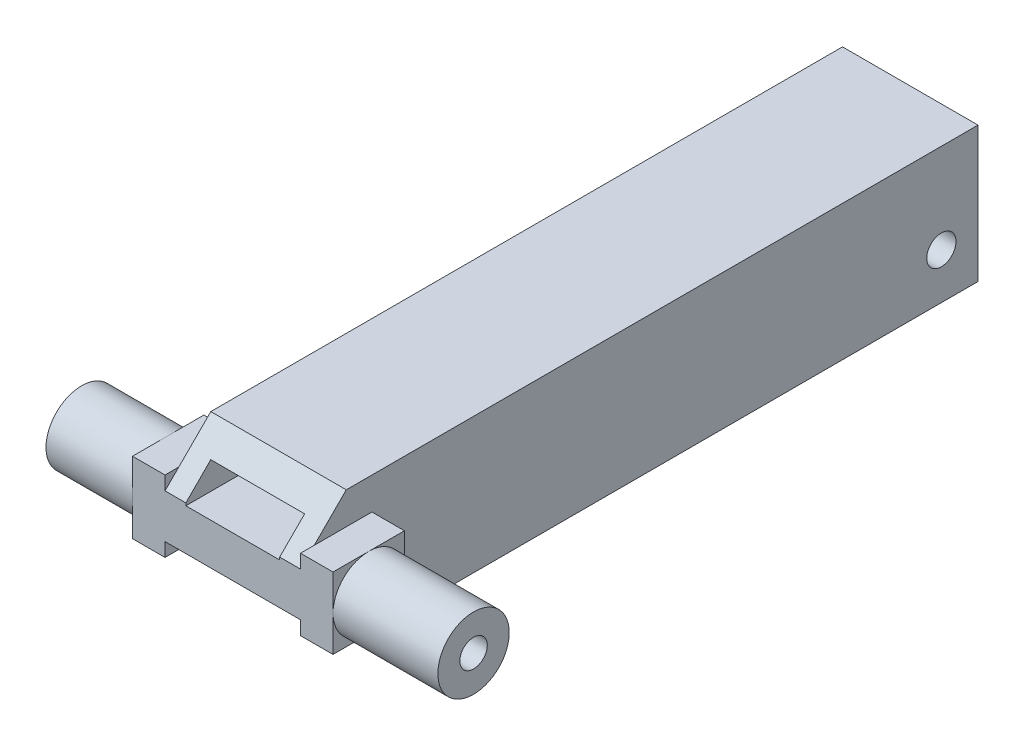
ISO-10303-21;
HEADER;
FILE_DESCRIPTION(('STEP AP214'),'2;1');
FILE_NAME('part.step','',(''),(''),'','','');
FILE_SCHEMA(('AUTOMOTIVE_DESIGN { 1 0 10303 214 1 1 1 1 }'));
ENDSEC;
DATA;
#1=APPLICATION_CONTEXT('core data for automotive mechanical design processes');
#2=APPLICATION_PROTOCOL_DEFINITION('international standard','automotive_design',2000,#1);
#3=PRODUCT_CONTEXT('',#1,'mechanical');
#4=PRODUCT('Part','Part','',(#3));
#5=PRODUCT_RELATED_PRODUCT_CATEGORY('part','',(#4));
#6=PRODUCT_DEFINITION_FORMATION('','',#4);
#7=PRODUCT_DEFINITION_CONTEXT('part definition',#1,'design');
#8=PRODUCT_DEFINITION('design','',#6,#7);
#9=PRODUCT_DEFINITION_SHAPE('','',#8);
#10=(LENGTH_UNIT() NAMED_UNIT(*) SI_UNIT(.MILLI.,.METRE.));
#11=(NAMED_UNIT(*) PLANE_ANGLE_UNIT() SI_UNIT($,.RADIAN.));
#12=(NAMED_UNIT(*) SI_UNIT($,.STERADIAN.) SOLID_ANGLE_UNIT());
#13=UNCERTAINTY_MEASURE_WITH_UNIT(LENGTH_MEASURE(1.E-05),#10,'distance_accuracy_value','');
#14=(GEOMETRIC_REPRESENTATION_CONTEXT(3) GLOBAL_UNCERTAINTY_ASSIGNED_CONTEXT((#13)) GLOBAL_UNIT_ASSIGNED_CONTEXT((#10,
#11,#12)) REPRESENTATION_CONTEXT('',''));
#15=CARTESIAN_POINT('',(0.,0.,0.));
#16=DIRECTION('',(0.,0.,1.));
#17=DIRECTION('',(1.,0.,0.));
#18=AXIS2_PLACEMENT_3D('',#15,#16,#17);
#19=CARTESIAN_POINT('',(14.8,0.,0.));
#20=DIRECTION('',(1.,0.,0.));
#21=DIRECTION('',(0.,0.,-1.));
#22=AXIS2_PLACEMENT_3D('',#19,#20,#21);
#23=PLANE('',#22);
#24=CARTESIAN_POINT('',(14.8,-2.4,-33.));
#25=DIRECTION('',(1.,0.,0.));
#26=DIRECTION('',(0.,0.,-1.));
#27=AXIS2_PLACEMENT_3D('',#24,#25,#26);
#28=CIRCLE('',#27,1.6);
#29=CARTESIAN_POINT('',(14.8,-2.4,-34.6));
#30=VERTEX_POINT('',#29);
#31=EDGE_CURVE('E252',#30,#30,#28,.T.);
#32=ORIENTED_EDGE('',*,*,#31,.F.);
#33=EDGE_LOOP('',(#32));
#34=FACE_BOUND('',#33,.T.);
#35=DIRECTION('',(0.,0.707106781186547,-0.707106781186548));
#36=VECTOR('',#35,1.);
#37=CARTESIAN_POINT('',(14.8,19.7,19.6999999999999));
#38=LINE('',#37,#36);
#39=CARTESIAN_POINT('',(14.8,7.4,32.));
#40=VERTEX_POINT('',#39);
#41=CARTESIAN_POINT('',(14.8,3.9,35.5));
#42=VERTEX_POINT('',#41);
#43=EDGE_CURVE('E412',#40,#42,#38,.F.);
#44=ORIENTED_EDGE('',*,*,#43,.T.);
#45=DIRECTION('',(0.,0.,1.));
#46=VECTOR('',#45,1.);
#47=CARTESIAN_POINT('',(14.8,3.89999999999999,37.));
#48=LINE('',#47,#46);
#49=CARTESIAN_POINT('',(14.8,3.89999999999999,29.2));
#50=VERTEX_POINT('',#49);
#51=EDGE_CURVE('E277',#50,#42,#48,.T.);
#52=ORIENTED_EDGE('',*,*,#51,.F.);
#53=DIRECTION('',(0.,1.,0.));
#54=VECTOR('',#53,1.);
#55=CARTESIAN_POINT('',(14.8,-3.89999999999999,29.2));
#56=LINE('',#55,#54);
#57=CARTESIAN_POINT('',(14.8,-3.89999999999999,29.2));
#58=VERTEX_POINT('',#57);
#59=EDGE_CURVE('E255',#58,#50,#56,.T.);
#60=ORIENTED_EDGE('',*,*,#59,.F.);
#61=DIRECTION('',(0.,0.,-1.));
#62=VECTOR('',#61,1.);
#63=CARTESIAN_POINT('',(14.8,-3.9,37.));
#64=LINE('',#63,#62);
#65=CARTESIAN_POINT('',(14.8,-3.89999999999999,35.5));
#66=VERTEX_POINT('',#65);
#67=EDGE_CURVE('E280',#66,#58,#64,.T.);
#68=ORIENTED_EDGE('',*,*,#67,.F.);
#69=DIRECTION('',(0.,0.707106781186549,0.707106781186546));
#70=VECTOR('',#69,1.);
#71=CARTESIAN_POINT('',(14.8,-19.7,19.7000000000001));
#72=LINE('',#71,#70);
#73=CARTESIAN_POINT('',(14.8,-7.4,32.));
#74=VERTEX_POINT('',#73);
#75=EDGE_CURVE('E415',#66,#74,#72,.F.);
#76=ORIENTED_EDGE('',*,*,#75,.T.);
#77=DIRECTION('',(0.,0.,-1.));
#78=VECTOR('',#77,1.);
#79=CARTESIAN_POINT('',(14.8,-7.4,-37.));
#80=LINE('',#79,#78);
#81=CARTESIAN_POINT('',(14.8,-7.4,-37.));
#82=VERTEX_POINT('',#81);
#83=EDGE_CURVE('E379',#74,#82,#80,.T.);
#84=ORIENTED_EDGE('',*,*,#83,.T.);
#85=DIRECTION('',(0.,1.,0.));
#86=VECTOR('',#85,1.);
#87=CARTESIAN_POINT('',(14.8,-7.4,-37.));
#88=LINE('',#87,#86);
#89=CARTESIAN_POINT('',(14.8,7.40000000000001,-37.));
#90=VERTEX_POINT('',#89);
#91=EDGE_CURVE('E381',#82,#90,#88,.T.);
#92=ORIENTED_EDGE('',*,*,#91,.T.);
#93=DIRECTION('',(0.,0.,1.));
#94=VECTOR('',#93,1.);
#95=CARTESIAN_POINT('',(14.8,7.40000000000001,-37.));
#96=LINE('',#95,#94);
#97=EDGE_CURVE('E384',#90,#40,#96,.T.);
#98=ORIENTED_EDGE('',*,*,#97,.T.);
#99=EDGE_LOOP('',(#44,#52,#60,#68,#76,#84,#92,#98));
#100=FACE_BOUND('',#99,.T.);
#101=ADVANCED_FACE('F34',(#34,#100),#23,.T.);
#102=CARTESIAN_POINT('',(0.,0.,0.));
#103=DIRECTION('',(1.,0.,0.));
#104=DIRECTION('',(0.,0.,-1.));
#105=AXIS2_PLACEMENT_3D('',#102,#103,#104);
#106=PLANE('',#105);
#107=CARTESIAN_POINT('',(0.,-2.4,-33.));
#108=DIRECTION('',(-1.,0.,0.));
#109=DIRECTION('',(0.,0.,1.));
#110=AXIS2_PLACEMENT_3D('',#107,#108,#109);
#111=CIRCLE('',#110,1.6);
#112=CARTESIAN_POINT('',(0.,-2.4,-31.4));
#113=VERTEX_POINT('',#112);
#114=EDGE_CURVE('E243',#113,#113,#111,.T.);
#115=ORIENTED_EDGE('',*,*,#114,.F.);
#116=EDGE_LOOP('',(#115));
#117=FACE_BOUND('',#116,.T.);
#118=DIRECTION('',(0.,0.,1.));
#119=VECTOR('',#118,1.);
#120=CARTESIAN_POINT('',(0.,-3.89999999999999,37.));
#121=LINE('',#120,#119);
#122=CARTESIAN_POINT('',(0.,-3.89999999999999,29.2));
#123=VERTEX_POINT('',#122);
#124=CARTESIAN_POINT('',(0.,-3.89999999999999,35.5));
#125=VERTEX_POINT('',#124);
#126=EDGE_CURVE('E325',#123,#125,#121,.T.);
#127=ORIENTED_EDGE('',*,*,#126,.F.);
#128=DIRECTION('',(0.,-1.,0.));
#129=VECTOR('',#128,1.);
#130=CARTESIAN_POINT('',(0.,-3.89999999999999,29.2));
#131=LINE('',#130,#129);
#132=CARTESIAN_POINT('',(0.,3.89999999999999,29.2));
#133=VERTEX_POINT('',#132);
#134=EDGE_CURVE('E320',#133,#123,#131,.T.);
#135=ORIENTED_EDGE('',*,*,#134,.F.);
#136=DIRECTION('',(0.,0.,-1.));
#137=VECTOR('',#136,1.);
#138=CARTESIAN_POINT('',(0.,3.89999999999999,37.));
#139=LINE('',#138,#137);
#140=CARTESIAN_POINT('',(0.,3.89999999999999,35.5));
#141=VERTEX_POINT('',#140);
#142=EDGE_CURVE('E329',#141,#133,#139,.T.);
#143=ORIENTED_EDGE('',*,*,#142,.F.);
#144=DIRECTION('',(0.,-0.707106781186547,0.707106781186548));
#145=VECTOR('',#144,1.);
#146=CARTESIAN_POINT('',(0.,2.39999999999999,37.));
#147=LINE('',#146,#145);
#148=CARTESIAN_POINT('',(0.,7.4,32.));
#149=VERTEX_POINT('',#148);
#150=EDGE_CURVE('E401',#141,#149,#147,.F.);
#151=ORIENTED_EDGE('',*,*,#150,.T.);
#152=DIRECTION('',(0.,0.,1.));
#153=VECTOR('',#152,1.);
#154=CARTESIAN_POINT('',(0.,7.40000000000001,-37.));
#155=LINE('',#154,#153);
#156=CARTESIAN_POINT('',(0.,7.40000000000001,-37.));
#157=VERTEX_POINT('',#156);
#158=EDGE_CURVE('E382',#157,#149,#155,.T.);
#159=ORIENTED_EDGE('',*,*,#158,.F.);
#160=DIRECTION('',(0.,1.,0.));
#161=VECTOR('',#160,1.);
#162=CARTESIAN_POINT('',(0.,-7.4,-37.));
#163=LINE('',#162,#161);
#164=CARTESIAN_POINT('',(0.,-7.4,-37.));
#165=VERTEX_POINT('',#164);
#166=EDGE_CURVE('E389',#165,#157,#163,.T.);
#167=ORIENTED_EDGE('',*,*,#166,.F.);
#168=DIRECTION('',(0.,0.,-1.));
#169=VECTOR('',#168,1.);
#170=CARTESIAN_POINT('',(0.,-7.4,-37.));
#171=LINE('',#170,#169);
#172=CARTESIAN_POINT('',(0.,-7.4,32.));
#173=VERTEX_POINT('',#172);
#174=EDGE_CURVE('E373',#173,#165,#171,.T.);
#175=ORIENTED_EDGE('',*,*,#174,.F.);
#176=DIRECTION('',(0.,-0.707106781186549,-0.707106781186546));
#177=VECTOR('',#176,1.);
#178=CARTESIAN_POINT('',(0.,-7.4,32.));
#179=LINE('',#178,#177);
#180=EDGE_CURVE('E405',#173,#125,#179,.F.);
#181=ORIENTED_EDGE('',*,*,#180,.T.);
#182=EDGE_LOOP('',(#127,#135,#143,#151,#159,#167,#175,#181));
#183=FACE_BOUND('',#182,.T.);
#184=ADVANCED_FACE('F453',(#117,#183),#106,.F.);
#185=CARTESIAN_POINT('',(14.8,-7.4,37.));
#186=DIRECTION('',(0.,0.,-1.));
#187=DIRECTION('',(-1.,0.,0.));
#188=AXIS2_PLACEMENT_3D('',#185,#186,#187);
#189=PLANE('',#188);
#190=DIRECTION('',(-1.,0.,0.));
#191=VECTOR('',#190,1.);
#192=CARTESIAN_POINT('',(14.8,2.39999999999999,37.));
#193=LINE('',#192,#191);
#194=CARTESIAN_POINT('',(14.8,2.39999999999999,37.));
#195=VERTEX_POINT('',#194);
#196=CARTESIAN_POINT('',(12.525,2.39999999999999,37.));
#197=VERTEX_POINT('',#196);
#198=EDGE_CURVE('E232',#195,#197,#193,.T.);
#199=ORIENTED_EDGE('',*,*,#198,.T.);
#200=DIRECTION('',(0.,-1.,0.));
#201=VECTOR('',#200,1.);
#202=CARTESIAN_POINT('',(12.525,2.125,37.));
#203=LINE('',#202,#201);
#204=CARTESIAN_POINT('',(12.525,2.125,37.));
#205=VERTEX_POINT('',#204);
#206=EDGE_CURVE('E215',#197,#205,#203,.T.);
#207=ORIENTED_EDGE('',*,*,#206,.T.);
#208=DIRECTION('',(-1.,0.,0.));
#209=VECTOR('',#208,1.);
#210=CARTESIAN_POINT('',(2.275,2.125,37.));
#211=LINE('',#210,#209);
#212=CARTESIAN_POINT('',(2.275,2.125,37.));
#213=VERTEX_POINT('',#212);
#214=EDGE_CURVE('E223',#205,#213,#211,.T.);
#215=ORIENTED_EDGE('',*,*,#214,.T.);
#216=DIRECTION('',(0.,1.,0.));
#217=VECTOR('',#216,1.);
#218=CARTESIAN_POINT('',(2.275,2.125,37.));
#219=LINE('',#218,#217);
#220=CARTESIAN_POINT('',(2.275,2.39999999999999,37.));
#221=VERTEX_POINT('',#220);
#222=EDGE_CURVE('E220',#213,#221,#219,.T.);
#223=ORIENTED_EDGE('',*,*,#222,.T.);
#224=CARTESIAN_POINT('',(0.,2.39999999999999,37.));
#225=VERTEX_POINT('',#224);
#226=EDGE_CURVE('E408',#221,#225,#193,.T.);
#227=ORIENTED_EDGE('',*,*,#226,.T.);
#228=DIRECTION('',(0.,1.,0.));
#229=VECTOR('',#228,1.);
#230=CARTESIAN_POINT('',(0.,-3.89999999999999,37.));
#231=LINE('',#230,#229);
#232=CARTESIAN_POINT('',(0.,3.89999999999999,37.));
#233=VERTEX_POINT('',#232);
#234=EDGE_CURVE('E330',#225,#233,#231,.T.);
#235=ORIENTED_EDGE('',*,*,#234,.T.);
#236=DIRECTION('',(1.,0.,0.));
#237=VECTOR('',#236,1.);
#238=CARTESIAN_POINT('',(-3.55,3.89999999999999,37.));
#239=LINE('',#238,#237);
#240=CARTESIAN_POINT('',(-3.55,3.89999999999999,37.));
#241=VERTEX_POINT('',#240);
#242=EDGE_CURVE('E336',#241,#233,#239,.T.);
#243=ORIENTED_EDGE('',*,*,#242,.F.);
#244=DIRECTION('',(0.,1.,0.));
#245=VECTOR('',#244,1.);
#246=CARTESIAN_POINT('',(-3.55,-3.89999999999999,37.));
#247=LINE('',#246,#245);
#248=CARTESIAN_POINT('',(-3.55,0.,37.));
#249=VERTEX_POINT('',#248);
#250=EDGE_CURVE('E312',#249,#241,#247,.T.);
#251=ORIENTED_EDGE('',*,*,#250,.F.);
#252=CARTESIAN_POINT('',(-3.55,-3.89999999999999,37.));
#253=VERTEX_POINT('',#252);
#254=EDGE_CURVE('E313',#253,#249,#247,.T.);
#255=ORIENTED_EDGE('',*,*,#254,.F.);
#256=DIRECTION('',(1.,0.,0.));
#257=VECTOR('',#256,1.);
#258=CARTESIAN_POINT('',(-3.55,-3.89999999999999,37.));
#259=LINE('',#258,#257);
#260=CARTESIAN_POINT('',(0.,-3.89999999999999,37.));
#261=VERTEX_POINT('',#260);
#262=EDGE_CURVE('E339',#253,#261,#259,.T.);
#263=ORIENTED_EDGE('',*,*,#262,.T.);
#264=CARTESIAN_POINT('',(0.,-2.39999999999999,37.));
#265=VERTEX_POINT('',#264);
#266=EDGE_CURVE('E326',#261,#265,#231,.T.);
#267=ORIENTED_EDGE('',*,*,#266,.T.);
#268=DIRECTION('',(1.,0.,0.));
#269=VECTOR('',#268,1.);
#270=CARTESIAN_POINT('',(14.8,-2.39999999999999,37.));
#271=LINE('',#270,#269);
#272=CARTESIAN_POINT('',(14.8,-2.39999999999999,37.));
#273=VERTEX_POINT('',#272);
#274=EDGE_CURVE('E410',#265,#273,#271,.T.);
#275=ORIENTED_EDGE('',*,*,#274,.T.);
#276=DIRECTION('',(0.,-1.,0.));
#277=VECTOR('',#276,1.);
#278=CARTESIAN_POINT('',(14.8,-3.9,37.));
#279=LINE('',#278,#277);
#280=CARTESIAN_POINT('',(14.8,-3.9,37.));
#281=VERTEX_POINT('',#280);
#282=EDGE_CURVE('E281',#273,#281,#279,.T.);
#283=ORIENTED_EDGE('',*,*,#282,.T.);
#284=DIRECTION('',(-1.,0.,0.));
#285=VECTOR('',#284,1.);
#286=CARTESIAN_POINT('',(18.35,-3.9,37.));
#287=LINE('',#286,#285);
#288=CARTESIAN_POINT('',(18.35,-3.9,37.));
#289=VERTEX_POINT('',#288);
#290=EDGE_CURVE('E287',#289,#281,#287,.T.);
#291=ORIENTED_EDGE('',*,*,#290,.F.);
#292=DIRECTION('',(0.,-1.,0.));
#293=VECTOR('',#292,1.);
#294=CARTESIAN_POINT('',(18.35,-3.9,37.));
#295=LINE('',#294,#293);
#296=CARTESIAN_POINT('',(18.35,0.,37.));
#297=VERTEX_POINT('',#296);
#298=EDGE_CURVE('E264',#297,#289,#295,.T.);
#299=ORIENTED_EDGE('',*,*,#298,.F.);
#300=CARTESIAN_POINT('',(18.35,3.89999999999999,37.));
#301=VERTEX_POINT('',#300);
#302=EDGE_CURVE('E265',#301,#297,#295,.T.);
#303=ORIENTED_EDGE('',*,*,#302,.F.);
#304=DIRECTION('',(-1.,0.,0.));
#305=VECTOR('',#304,1.);
#306=CARTESIAN_POINT('',(18.35,3.89999999999999,37.));
#307=LINE('',#306,#305);
#308=CARTESIAN_POINT('',(14.8,3.89999999999999,37.));
#309=VERTEX_POINT('',#308);
#310=EDGE_CURVE('E290',#301,#309,#307,.T.);
#311=ORIENTED_EDGE('',*,*,#310,.T.);
#312=EDGE_CURVE('E278',#309,#195,#279,.T.);
#313=ORIENTED_EDGE('',*,*,#312,.T.);
#314=EDGE_LOOP('',(#199,#207,#215,#223,#227,#235,#243,#251,#255,#263,#267,#275,#283,#291,#299,
#303,#311,#313));
#315=FACE_BOUND('',#314,.T.);
#316=ADVANCED_FACE('F230',(#315),#189,.F.);
#317=CARTESIAN_POINT('',(14.8,-7.4,-37.));
#318=DIRECTION('',(0.,1.,0.));
#319=DIRECTION('',(0.,0.,1.));
#320=AXIS2_PLACEMENT_3D('',#317,#318,#319);
#321=PLANE('',#320);
#322=ORIENTED_EDGE('',*,*,#83,.F.);
#323=DIRECTION('',(-1.,0.,0.));
#324=VECTOR('',#323,1.);
#325=CARTESIAN_POINT('',(14.8,-7.4,32.));
#326=LINE('',#325,#324);
#327=EDGE_CURVE('E398',#74,#173,#326,.T.);
#328=ORIENTED_EDGE('',*,*,#327,.T.);
#329=ORIENTED_EDGE('',*,*,#174,.T.);
#330=DIRECTION('',(-1.,0.,0.));
#331=VECTOR('',#330,1.);
#332=CARTESIAN_POINT('',(14.8,-7.4,-37.));
#333=LINE('',#332,#331);
#334=EDGE_CURVE('E395',#82,#165,#333,.T.);
#335=ORIENTED_EDGE('',*,*,#334,.F.);
#336=EDGE_LOOP('',(#322,#328,#329,#335));
#337=FACE_BOUND('',#336,.T.);
#338=ADVANCED_FACE('F504',(#337),#321,.F.);
#339=CARTESIAN_POINT('',(14.8,-7.4,-37.));
#340=DIRECTION('',(0.,0.,1.));
#341=DIRECTION('',(1.,0.,0.));
#342=AXIS2_PLACEMENT_3D('',#339,#340,#341);
#343=PLANE('',#342);
#344=DIRECTION('',(-1.,0.,0.));
#345=VECTOR('',#344,1.);
#346=CARTESIAN_POINT('',(2.275,-5.125,-37.));
#347=LINE('',#346,#345);
#348=CARTESIAN_POINT('',(12.525,-5.125,-37.));
#349=VERTEX_POINT('',#348);
#350=CARTESIAN_POINT('',(2.275,-5.125,-37.));
#351=VERTEX_POINT('',#350);
#352=EDGE_CURVE('E364',#349,#351,#347,.T.);
#353=ORIENTED_EDGE('',*,*,#352,.F.);
#354=DIRECTION('',(0.,-1.,0.));
#355=VECTOR('',#354,1.);
#356=CARTESIAN_POINT('',(12.525,-5.125,-37.));
#357=LINE('',#356,#355);
#358=CARTESIAN_POINT('',(12.525,5.125,-37.));
#359=VERTEX_POINT('',#358);
#360=EDGE_CURVE('E353',#359,#349,#357,.T.);
#361=ORIENTED_EDGE('',*,*,#360,.F.);
#362=DIRECTION('',(1.,0.,0.));
#363=VECTOR('',#362,1.);
#364=CARTESIAN_POINT('',(2.275,5.125,-37.));
#365=LINE('',#364,#363);
#366=CARTESIAN_POINT('',(2.275,5.125,-37.));
#367=VERTEX_POINT('',#366);
#368=EDGE_CURVE('E356',#367,#359,#365,.T.);
#369=ORIENTED_EDGE('',*,*,#368,.F.);
#370=DIRECTION('',(0.,1.,0.));
#371=VECTOR('',#370,1.);
#372=CARTESIAN_POINT('',(2.275,-5.125,-37.));
#373=LINE('',#372,#371);
#374=EDGE_CURVE('E367',#351,#367,#373,.T.);
#375=ORIENTED_EDGE('',*,*,#374,.F.);
#376=EDGE_LOOP('',(#353,#361,#369,#375));
#377=FACE_BOUND('',#376,.T.);
#378=ORIENTED_EDGE('',*,*,#166,.T.);
#379=DIRECTION('',(-1.,0.,0.));
#380=VECTOR('',#379,1.);
#381=CARTESIAN_POINT('',(14.8,7.40000000000001,-37.));
#382=LINE('',#381,#380);
#383=EDGE_CURVE('E387',#90,#157,#382,.T.);
#384=ORIENTED_EDGE('',*,*,#383,.F.);
#385=ORIENTED_EDGE('',*,*,#91,.F.);
#386=ORIENTED_EDGE('',*,*,#334,.T.);
#387=EDGE_LOOP('',(#378,#384,#385,#386));
#388=FACE_BOUND('',#387,.T.);
#389=ADVANCED_FACE('F507',(#377,#388),#343,.F.);
#390=CARTESIAN_POINT('',(14.8,7.40000000000001,-37.));
#391=DIRECTION('',(0.,-1.,0.));
#392=DIRECTION('',(0.,0.,-1.));
#393=AXIS2_PLACEMENT_3D('',#390,#391,#392);
#394=PLANE('',#393);
#395=ORIENTED_EDGE('',*,*,#158,.T.);
#396=DIRECTION('',(1.,0.,0.));
#397=VECTOR('',#396,1.);
#398=CARTESIAN_POINT('',(14.8,7.4,32.));
#399=LINE('',#398,#397);
#400=EDGE_CURVE('E419',#149,#40,#399,.T.);
#401=ORIENTED_EDGE('',*,*,#400,.T.);
#402=ORIENTED_EDGE('',*,*,#97,.F.);
#403=ORIENTED_EDGE('',*,*,#383,.T.);
#404=EDGE_LOOP('',(#395,#401,#402,#403));
#405=FACE_BOUND('',#404,.T.);
#406=ADVANCED_FACE('F468',(#405),#394,.F.);
#407=CARTESIAN_POINT('',(12.525,-5.125,28.));
#408=DIRECTION('',(1.,0.,0.));
#409=DIRECTION('',(0.,1.,0.));
#410=AXIS2_PLACEMENT_3D('',#407,#408,#409);
#411=PLANE('',#410);
#412=CARTESIAN_POINT('',(12.525,-2.4,-33.));
#413=DIRECTION('',(1.,0.,0.));
#414=DIRECTION('',(0.,1.,0.));
#415=AXIS2_PLACEMENT_3D('',#412,#413,#414);
#416=CIRCLE('',#415,1.6);
#417=CARTESIAN_POINT('',(12.525,-0.800000000000005,-33.));
#418=VERTEX_POINT('',#417);
#419=EDGE_CURVE('E249',#418,#418,#416,.T.);
#420=ORIENTED_EDGE('',*,*,#419,.T.);
#421=EDGE_LOOP('',(#420));
#422=FACE_BOUND('',#421,.T.);
#423=ORIENTED_EDGE('',*,*,#360,.T.);
#424=DIRECTION('',(0.,0.,-1.));
#425=VECTOR('',#424,1.);
#426=CARTESIAN_POINT('',(12.525,-5.125,28.));
#427=LINE('',#426,#425);
#428=CARTESIAN_POINT('',(12.525,-5.125,28.));
#429=VERTEX_POINT('',#428);
#430=EDGE_CURVE('E362',#429,#349,#427,.T.);
#431=ORIENTED_EDGE('',*,*,#430,.F.);
#432=DIRECTION('',(0.,-1.,0.));
#433=VECTOR('',#432,1.);
#434=CARTESIAN_POINT('',(12.525,-5.125,28.));
#435=LINE('',#434,#433);
#436=CARTESIAN_POINT('',(12.525,2.125,28.));
#437=VERTEX_POINT('',#436);
#438=EDGE_CURVE('E218',#437,#429,#435,.T.);
#439=ORIENTED_EDGE('',*,*,#438,.F.);
#440=DIRECTION('',(0.,0.,-1.));
#441=VECTOR('',#440,1.);
#442=CARTESIAN_POINT('',(12.525,2.125,37.));
#443=LINE('',#442,#441);
#444=EDGE_CURVE('E49',#205,#437,#443,.T.);
#445=ORIENTED_EDGE('',*,*,#444,.F.);
#446=ORIENTED_EDGE('',*,*,#206,.F.);
#447=DIRECTION('',(0.,-0.707106781186547,0.707106781186548));
#448=VECTOR('',#447,1.);
#449=CARTESIAN_POINT('',(12.525,2.39999999999998,37.));
#450=LINE('',#449,#448);
#451=CARTESIAN_POINT('',(12.525,5.125,34.275));
#452=VERTEX_POINT('',#451);
#453=EDGE_CURVE('E11',#197,#452,#450,.F.);
#454=ORIENTED_EDGE('',*,*,#453,.T.);
#455=DIRECTION('',(0.,0.,-1.));
#456=VECTOR('',#455,1.);
#457=CARTESIAN_POINT('',(12.525,5.125,28.));
#458=LINE('',#457,#456);
#459=EDGE_CURVE('E371',#452,#359,#458,.T.);
#460=ORIENTED_EDGE('',*,*,#459,.T.);
#461=EDGE_LOOP('',(#423,#431,#439,#445,#446,#454,#460));
#462=FACE_BOUND('',#461,.T.);
#463=ADVANCED_FACE('F213',(#422,#462),#411,.F.);
#464=CARTESIAN_POINT('',(2.275,5.125,28.));
#465=DIRECTION('',(0.,1.,0.));
#466=DIRECTION('',(0.,0.,1.));
#467=AXIS2_PLACEMENT_3D('',#464,#465,#466);
#468=PLANE('',#467);
#469=ORIENTED_EDGE('',*,*,#368,.T.);
#470=ORIENTED_EDGE('',*,*,#459,.F.);
#471=DIRECTION('',(1.,0.,0.));
#472=VECTOR('',#471,1.);
#473=CARTESIAN_POINT('',(14.8,5.125,34.275));
#474=LINE('',#473,#472);
#475=CARTESIAN_POINT('',(2.275,5.125,34.275));
#476=VERTEX_POINT('',#475);
#477=EDGE_CURVE('E42',#452,#476,#474,.F.);
#478=ORIENTED_EDGE('',*,*,#477,.T.);
#479=DIRECTION('',(0.,0.,-1.));
#480=VECTOR('',#479,1.);
#481=CARTESIAN_POINT('',(2.275,5.125,28.));
#482=LINE('',#481,#480);
#483=EDGE_CURVE('E57',#476,#367,#482,.T.);
#484=ORIENTED_EDGE('',*,*,#483,.T.);
#485=EDGE_LOOP('',(#469,#470,#478,#484));
#486=FACE_BOUND('',#485,.T.);
#487=ADVANCED_FACE('F432',(#486),#468,.F.);
#488=CARTESIAN_POINT('',(2.275,-5.125,28.));
#489=DIRECTION('',(-1.,0.,0.));
#490=DIRECTION('',(0.,0.,1.));
#491=AXIS2_PLACEMENT_3D('',#488,#489,#490);
#492=PLANE('',#491);
#493=CARTESIAN_POINT('',(2.275,-2.4,-33.));
#494=DIRECTION('',(-1.,0.,0.));
#495=DIRECTION('',(0.,0.,1.));
#496=AXIS2_PLACEMENT_3D('',#493,#494,#495);
#497=CIRCLE('',#496,1.6);
#498=CARTESIAN_POINT('',(2.275,-2.4,-31.4));
#499=VERTEX_POINT('',#498);
#500=EDGE_CURVE('E248',#499,#499,#497,.T.);
#501=ORIENTED_EDGE('',*,*,#500,.T.);
#502=EDGE_LOOP('',(#501));
#503=FACE_BOUND('',#502,.T.);
#504=ORIENTED_EDGE('',*,*,#374,.T.);
#505=ORIENTED_EDGE('',*,*,#483,.F.);
#506=DIRECTION('',(0.,0.707106781186547,-0.707106781186548));
#507=VECTOR('',#506,1.);
#508=CARTESIAN_POINT('',(2.275,2.39999999999999,37.));
#509=LINE('',#508,#507);
#510=EDGE_CURVE('E428',#476,#221,#509,.F.);
#511=ORIENTED_EDGE('',*,*,#510,.T.);
#512=ORIENTED_EDGE('',*,*,#222,.F.);
#513=DIRECTION('',(0.,0.,-1.));
#514=VECTOR('',#513,1.);
#515=CARTESIAN_POINT('',(2.275,2.125,37.));
#516=LINE('',#515,#514);
#517=CARTESIAN_POINT('',(2.275,2.125,28.));
#518=VERTEX_POINT('',#517);
#519=EDGE_CURVE('E219',#213,#518,#516,.T.);
#520=ORIENTED_EDGE('',*,*,#519,.T.);
#521=DIRECTION('',(0.,1.,0.));
#522=VECTOR('',#521,1.);
#523=CARTESIAN_POINT('',(2.275,-5.125,28.));
#524=LINE('',#523,#522);
#525=CARTESIAN_POINT('',(2.275,-5.125,28.));
#526=VERTEX_POINT('',#525);
#527=EDGE_CURVE('E359',#526,#518,#524,.T.);
#528=ORIENTED_EDGE('',*,*,#527,.F.);
#529=DIRECTION('',(0.,0.,-1.));
#530=VECTOR('',#529,1.);
#531=CARTESIAN_POINT('',(2.275,-5.125,28.));
#532=LINE('',#531,#530);
#533=EDGE_CURVE('E375',#526,#351,#532,.T.);
#534=ORIENTED_EDGE('',*,*,#533,.T.);
#535=EDGE_LOOP('',(#504,#505,#511,#512,#520,#528,#534));
#536=FACE_BOUND('',#535,.T.);
#537=ADVANCED_FACE('F436',(#503,#536),#492,.F.);
#538=CARTESIAN_POINT('',(2.275,-5.125,28.));
#539=DIRECTION('',(0.,-1.,0.));
#540=DIRECTION('',(0.,0.,-1.));
#541=AXIS2_PLACEMENT_3D('',#538,#539,#540);
#542=PLANE('',#541);
#543=ORIENTED_EDGE('',*,*,#352,.T.);
#544=ORIENTED_EDGE('',*,*,#533,.F.);
#545=DIRECTION('',(-1.,0.,0.));
#546=VECTOR('',#545,1.);
#547=CARTESIAN_POINT('',(2.275,-5.125,28.));
#548=LINE('',#547,#546);
#549=EDGE_CURVE('E355',#429,#526,#548,.T.);
#550=ORIENTED_EDGE('',*,*,#549,.F.);
#551=ORIENTED_EDGE('',*,*,#430,.T.);
#552=EDGE_LOOP('',(#543,#544,#550,#551));
#553=FACE_BOUND('',#552,.T.);
#554=ADVANCED_FACE('F531',(#553),#542,.F.);
#555=CARTESIAN_POINT('',(0.,0.,28.));
#556=DIRECTION('',(0.,0.,-1.));
#557=DIRECTION('',(-1.,0.,0.));
#558=AXIS2_PLACEMENT_3D('',#555,#556,#557);
#559=PLANE('',#558);
#560=DIRECTION('',(-1.,0.,0.));
#561=VECTOR('',#560,1.);
#562=CARTESIAN_POINT('',(2.275,2.125,28.));
#563=LINE('',#562,#561);
#564=EDGE_CURVE('E233',#437,#518,#563,.T.);
#565=ORIENTED_EDGE('',*,*,#564,.F.);
#566=ORIENTED_EDGE('',*,*,#438,.T.);
#567=ORIENTED_EDGE('',*,*,#549,.T.);
#568=ORIENTED_EDGE('',*,*,#527,.T.);
#569=EDGE_LOOP('',(#565,#566,#567,#568));
#570=FACE_BOUND('',#569,.T.);
#571=ADVANCED_FACE('F534',(#570),#559,.T.);
#572=CARTESIAN_POINT('',(-13.,0.,33.1));
#573=DIRECTION('',(1.,0.,0.));
#574=DIRECTION('',(0.,0.,-1.));
#575=AXIS2_PLACEMENT_3D('',#572,#573,#574);
#576=CYLINDRICAL_SURFACE('',#575,3.9);
#577=CARTESIAN_POINT('',(-13.,0.,33.1));
#578=DIRECTION('',(-1.,0.,0.));
#579=DIRECTION('',(0.,0.,1.));
#580=AXIS2_PLACEMENT_3D('',#577,#578,#579);
#581=CIRCLE('',#580,3.9);
#582=CARTESIAN_POINT('',(-13.,0.,37.));
#583=VERTEX_POINT('',#582);
#584=EDGE_CURVE('E347',#583,#583,#581,.T.);
#585=ORIENTED_EDGE('',*,*,#584,.F.);
#586=EDGE_LOOP('',(#585));
#587=FACE_BOUND('',#586,.T.);
#588=CARTESIAN_POINT('',(-3.55,0.,33.1));
#589=DIRECTION('',(-1.,0.,0.));
#590=DIRECTION('',(0.,0.,1.));
#591=AXIS2_PLACEMENT_3D('',#588,#589,#590);
#592=CIRCLE('',#591,3.9);
#593=CARTESIAN_POINT('',(-3.55,-3.89999999999999,33.1));
#594=VERTEX_POINT('',#593);
#595=EDGE_CURVE('E424',#594,#249,#592,.T.);
#596=ORIENTED_EDGE('',*,*,#595,.T.);
#597=CARTESIAN_POINT('',(-3.55,3.89999999999999,33.1));
#598=VERTEX_POINT('',#597);
#599=EDGE_CURVE('E425',#249,#598,#592,.T.);
#600=ORIENTED_EDGE('',*,*,#599,.T.);
#601=CARTESIAN_POINT('',(-3.55,0.,29.2));
#602=VERTEX_POINT('',#601);
#603=EDGE_CURVE('E421',#598,#602,#592,.T.);
#604=ORIENTED_EDGE('',*,*,#603,.T.);
#605=EDGE_CURVE('E874',#602,#594,#592,.T.);
#606=ORIENTED_EDGE('',*,*,#605,.T.);
#607=EDGE_LOOP('',(#596,#600,#604,#606));
#608=FACE_BOUND('',#607,.T.);
#609=ADVANCED_FACE('F543',(#587,#608),#576,.T.);
#610=CARTESIAN_POINT('',(-13.,0.,33.1));
#611=DIRECTION('',(-1.,0.,0.));
#612=DIRECTION('',(0.,0.,1.));
#613=AXIS2_PLACEMENT_3D('',#610,#611,#612);
#614=PLANE('',#613);
#615=CARTESIAN_POINT('',(-13.,0.,33.1));
#616=DIRECTION('',(1.,0.,0.));
#617=DIRECTION('',(0.,0.,-1.));
#618=AXIS2_PLACEMENT_3D('',#615,#616,#617);
#619=CIRCLE('',#618,1.5);
#620=CARTESIAN_POINT('',(-13.,0.,31.6));
#621=VERTEX_POINT('',#620);
#622=EDGE_CURVE('E240',#621,#621,#619,.T.);
#623=ORIENTED_EDGE('',*,*,#622,.T.);
#624=EDGE_LOOP('',(#623));
#625=FACE_BOUND('',#624,.T.);
#626=ORIENTED_EDGE('',*,*,#584,.T.);
#627=EDGE_LOOP('',(#626));
#628=FACE_BOUND('',#627,.T.);
#629=ADVANCED_FACE('F556',(#625,#628),#614,.T.);
#630=CARTESIAN_POINT('',(14.8,-7.4,32.));
#631=DIRECTION('',(0.,0.707106781186546,-0.707106781186549));
#632=DIRECTION('',(-1.,0.,0.));
#633=AXIS2_PLACEMENT_3D('',#630,#631,#632);
#634=PLANE('',#633);
#635=EDGE_CURVE('E416',#273,#66,#72,.F.);
#636=ORIENTED_EDGE('',*,*,#635,.F.);
#637=ORIENTED_EDGE('',*,*,#274,.F.);
#638=DIRECTION('',(0.,0.707106781186549,0.707106781186546));
#639=VECTOR('',#638,1.);
#640=CARTESIAN_POINT('',(0.,-7.4,32.));
#641=LINE('',#640,#639);
#642=EDGE_CURVE('E345',#265,#125,#641,.F.);
#643=ORIENTED_EDGE('',*,*,#642,.T.);
#644=ORIENTED_EDGE('',*,*,#180,.F.);
#645=ORIENTED_EDGE('',*,*,#327,.F.);
#646=ORIENTED_EDGE('',*,*,#75,.F.);
#647=EDGE_LOOP('',(#636,#637,#643,#644,#645,#646));
#648=FACE_BOUND('',#647,.T.);
#649=ADVANCED_FACE('F498',(#648),#634,.F.);
#650=CARTESIAN_POINT('',(14.8,2.39999999999999,37.));
#651=DIRECTION('',(0.,-0.707106781186548,-0.707106781186547));
#652=DIRECTION('',(-1.,0.,0.));
#653=AXIS2_PLACEMENT_3D('',#650,#651,#652);
#654=PLANE('',#653);
#655=ORIENTED_EDGE('',*,*,#453,.F.);
#656=ORIENTED_EDGE('',*,*,#198,.F.);
#657=DIRECTION('',(0.,0.707106781186547,-0.707106781186548));
#658=VECTOR('',#657,1.);
#659=CARTESIAN_POINT('',(14.8,2.39999999999999,37.));
#660=LINE('',#659,#658);
#661=EDGE_CURVE('E296',#42,#195,#660,.F.);
#662=ORIENTED_EDGE('',*,*,#661,.F.);
#663=ORIENTED_EDGE('',*,*,#43,.F.);
#664=ORIENTED_EDGE('',*,*,#400,.F.);
#665=ORIENTED_EDGE('',*,*,#150,.F.);
#666=EDGE_CURVE('E402',#225,#141,#147,.F.);
#667=ORIENTED_EDGE('',*,*,#666,.F.);
#668=ORIENTED_EDGE('',*,*,#226,.F.);
#669=ORIENTED_EDGE('',*,*,#510,.F.);
#670=ORIENTED_EDGE('',*,*,#477,.F.);
#671=EDGE_LOOP('',(#655,#656,#662,#663,#664,#665,#667,#668,#669,#670));
#672=FACE_BOUND('',#671,.T.);
#673=ADVANCED_FACE('F36',(#672),#654,.F.);
#674=CARTESIAN_POINT('',(-3.55,0.,0.));
#675=DIRECTION('',(-1.,0.,0.));
#676=DIRECTION('',(0.,0.,1.));
#677=AXIS2_PLACEMENT_3D('',#674,#675,#676);
#678=PLANE('',#677);
#679=ORIENTED_EDGE('',*,*,#599,.F.);
#680=ORIENTED_EDGE('',*,*,#250,.T.);
#681=DIRECTION('',(0.,0.,-1.));
#682=VECTOR('',#681,1.);
#683=CARTESIAN_POINT('',(-3.55,3.89999999999999,37.));
#684=LINE('',#683,#682);
#685=EDGE_CURVE('E316',#241,#598,#684,.T.);
#686=ORIENTED_EDGE('',*,*,#685,.T.);
#687=EDGE_LOOP('',(#679,#680,#686));
#688=FACE_BOUND('',#687,.T.);
#689=ADVANCED_FACE('F576',(#688),#678,.T.);
#690=ORIENTED_EDGE('',*,*,#603,.F.);
#691=CARTESIAN_POINT('',(-3.55,3.89999999999999,29.2));
#692=VERTEX_POINT('',#691);
#693=EDGE_CURVE('E315',#598,#692,#684,.T.);
#694=ORIENTED_EDGE('',*,*,#693,.T.);
#695=DIRECTION('',(0.,-1.,0.));
#696=VECTOR('',#695,1.);
#697=CARTESIAN_POINT('',(-3.55,-3.89999999999999,29.2));
#698=LINE('',#697,#696);
#699=EDGE_CURVE('E304',#692,#602,#698,.T.);
#700=ORIENTED_EDGE('',*,*,#699,.T.);
#701=EDGE_LOOP('',(#690,#694,#700));
#702=FACE_BOUND('',#701,.T.);
#703=ADVANCED_FACE('F706',(#702),#678,.T.);
#704=ORIENTED_EDGE('',*,*,#605,.F.);
#705=CARTESIAN_POINT('',(-3.55,-3.89999999999999,29.2));
#706=VERTEX_POINT('',#705);
#707=EDGE_CURVE('E308',#602,#706,#698,.T.);
#708=ORIENTED_EDGE('',*,*,#707,.T.);
#709=DIRECTION('',(0.,0.,1.));
#710=VECTOR('',#709,1.);
#711=CARTESIAN_POINT('',(-3.55,-3.89999999999999,37.));
#712=LINE('',#711,#710);
#713=EDGE_CURVE('E309',#706,#594,#712,.T.);
#714=ORIENTED_EDGE('',*,*,#713,.T.);
#715=EDGE_LOOP('',(#704,#708,#714));
#716=FACE_BOUND('',#715,.T.);
#717=ADVANCED_FACE('F563',(#716),#678,.T.);
#718=CARTESIAN_POINT('',(-3.55,-3.89999999999999,29.2));
#719=DIRECTION('',(0.,0.,1.));
#720=DIRECTION('',(1.,0.,0.));
#721=AXIS2_PLACEMENT_3D('',#718,#719,#720);
#722=PLANE('',#721);
#723=ORIENTED_EDGE('',*,*,#707,.F.);
#724=ORIENTED_EDGE('',*,*,#699,.F.);
#725=DIRECTION('',(1.,0.,0.));
#726=VECTOR('',#725,1.);
#727=CARTESIAN_POINT('',(-3.55,3.89999999999999,29.2));
#728=LINE('',#727,#726);
#729=EDGE_CURVE('E319',#692,#133,#728,.T.);
#730=ORIENTED_EDGE('',*,*,#729,.T.);
#731=ORIENTED_EDGE('',*,*,#134,.T.);
#732=DIRECTION('',(1.,0.,0.));
#733=VECTOR('',#732,1.);
#734=CARTESIAN_POINT('',(-3.55,-3.89999999999999,29.2));
#735=LINE('',#734,#733);
#736=EDGE_CURVE('E342',#706,#123,#735,.T.);
#737=ORIENTED_EDGE('',*,*,#736,.F.);
#738=EDGE_LOOP('',(#723,#724,#730,#731,#737));
#739=FACE_BOUND('',#738,.T.);
#740=ADVANCED_FACE('F458',(#739),#722,.F.);
#741=CARTESIAN_POINT('',(-3.55,-3.89999999999999,37.));
#742=DIRECTION('',(0.,1.,0.));
#743=DIRECTION('',(0.,0.,1.));
#744=AXIS2_PLACEMENT_3D('',#741,#742,#743);
#745=PLANE('',#744);
#746=EDGE_CURVE('E307',#594,#253,#712,.T.);
#747=ORIENTED_EDGE('',*,*,#746,.F.);
#748=ORIENTED_EDGE('',*,*,#713,.F.);
#749=ORIENTED_EDGE('',*,*,#736,.T.);
#750=ORIENTED_EDGE('',*,*,#126,.T.);
#751=EDGE_CURVE('E323',#125,#261,#121,.T.);
#752=ORIENTED_EDGE('',*,*,#751,.T.);
#753=ORIENTED_EDGE('',*,*,#262,.F.);
#754=EDGE_LOOP('',(#747,#748,#749,#750,#752,#753));
#755=FACE_BOUND('',#754,.T.);
#756=ADVANCED_FACE('F447',(#755),#745,.F.);
#757=CARTESIAN_POINT('',(-3.55,3.89999999999999,37.));
#758=DIRECTION('',(0.,-1.,0.));
#759=DIRECTION('',(0.,0.,-1.));
#760=AXIS2_PLACEMENT_3D('',#757,#758,#759);
#761=PLANE('',#760);
#762=ORIENTED_EDGE('',*,*,#693,.F.);
#763=ORIENTED_EDGE('',*,*,#685,.F.);
#764=ORIENTED_EDGE('',*,*,#242,.T.);
#765=EDGE_CURVE('E331',#233,#141,#139,.T.);
#766=ORIENTED_EDGE('',*,*,#765,.T.);
#767=ORIENTED_EDGE('',*,*,#142,.T.);
#768=ORIENTED_EDGE('',*,*,#729,.F.);
#769=EDGE_LOOP('',(#762,#763,#764,#766,#767,#768));
#770=FACE_BOUND('',#769,.T.);
#771=ADVANCED_FACE('F463',(#770),#761,.F.);
#772=CARTESIAN_POINT('',(0.,0.,0.));
#773=DIRECTION('',(-1.,0.,0.));
#774=DIRECTION('',(0.,0.,1.));
#775=AXIS2_PLACEMENT_3D('',#772,#773,#774);
#776=PLANE('',#775);
#777=ORIENTED_EDGE('',*,*,#642,.F.);
#778=ORIENTED_EDGE('',*,*,#266,.F.);
#779=ORIENTED_EDGE('',*,*,#751,.F.);
#780=EDGE_LOOP('',(#777,#778,#779));
#781=FACE_BOUND('',#780,.T.);
#782=ADVANCED_FACE('F568',(#781),#776,.F.);
#783=ORIENTED_EDGE('',*,*,#595,.F.);
#784=ORIENTED_EDGE('',*,*,#746,.T.);
#785=ORIENTED_EDGE('',*,*,#254,.T.);
#786=EDGE_LOOP('',(#783,#784,#785));
#787=FACE_BOUND('',#786,.T.);
#788=ADVANCED_FACE('F572',(#787),#678,.T.);
#789=ORIENTED_EDGE('',*,*,#666,.T.);
#790=ORIENTED_EDGE('',*,*,#765,.F.);
#791=ORIENTED_EDGE('',*,*,#234,.F.);
#792=EDGE_LOOP('',(#789,#790,#791));
#793=FACE_BOUND('',#792,.T.);
#794=ADVANCED_FACE('F443',(#793),#776,.F.);
#795=CARTESIAN_POINT('',(18.35,-3.89999999999999,29.2));
#796=DIRECTION('',(0.,0.,1.));
#797=DIRECTION('',(1.,0.,0.));
#798=AXIS2_PLACEMENT_3D('',#795,#796,#797);
#799=PLANE('',#798);
#800=DIRECTION('',(0.,1.,0.));
#801=VECTOR('',#800,1.);
#802=CARTESIAN_POINT('',(18.35,-3.89999999999999,29.2));
#803=LINE('',#802,#801);
#804=CARTESIAN_POINT('',(18.35,0.,29.2));
#805=VERTEX_POINT('',#804);
#806=CARTESIAN_POINT('',(18.35,3.89999999999999,29.2));
#807=VERTEX_POINT('',#806);
#808=EDGE_CURVE('E260',#805,#807,#803,.T.);
#809=ORIENTED_EDGE('',*,*,#808,.F.);
#810=CARTESIAN_POINT('',(18.35,-3.89999999999999,29.2));
#811=VERTEX_POINT('',#810);
#812=EDGE_CURVE('E256',#811,#805,#803,.T.);
#813=ORIENTED_EDGE('',*,*,#812,.F.);
#814=DIRECTION('',(-1.,0.,0.));
#815=VECTOR('',#814,1.);
#816=CARTESIAN_POINT('',(18.35,-3.89999999999999,29.2));
#817=LINE('',#816,#815);
#818=EDGE_CURVE('E272',#811,#58,#817,.T.);
#819=ORIENTED_EDGE('',*,*,#818,.T.);
#820=ORIENTED_EDGE('',*,*,#59,.T.);
#821=DIRECTION('',(-1.,0.,0.));
#822=VECTOR('',#821,1.);
#823=CARTESIAN_POINT('',(18.35,3.89999999999999,29.2));
#824=LINE('',#823,#822);
#825=EDGE_CURVE('E293',#807,#50,#824,.T.);
#826=ORIENTED_EDGE('',*,*,#825,.F.);
#827=EDGE_LOOP('',(#809,#813,#819,#820,#826));
#828=FACE_BOUND('',#827,.T.);
#829=ADVANCED_FACE('F571',(#828),#799,.F.);
#830=CARTESIAN_POINT('',(18.35,3.89999999999999,37.));
#831=DIRECTION('',(0.,-1.,0.));
#832=DIRECTION('',(0.,0.,-1.));
#833=AXIS2_PLACEMENT_3D('',#830,#831,#832);
#834=PLANE('',#833);
#835=DIRECTION('',(0.,0.,1.));
#836=VECTOR('',#835,1.);
#837=CARTESIAN_POINT('',(18.35,3.89999999999999,37.));
#838=LINE('',#837,#836);
#839=CARTESIAN_POINT('',(18.35,3.89999999999999,33.1));
#840=VERTEX_POINT('',#839);
#841=EDGE_CURVE('E259',#840,#301,#838,.T.);
#842=ORIENTED_EDGE('',*,*,#841,.F.);
#843=EDGE_CURVE('E261',#807,#840,#838,.T.);
#844=ORIENTED_EDGE('',*,*,#843,.F.);
#845=ORIENTED_EDGE('',*,*,#825,.T.);
#846=ORIENTED_EDGE('',*,*,#51,.T.);
#847=EDGE_CURVE('E275',#42,#309,#48,.T.);
#848=ORIENTED_EDGE('',*,*,#847,.T.);
#849=ORIENTED_EDGE('',*,*,#310,.F.);
#850=EDGE_LOOP('',(#842,#844,#845,#846,#848,#849));
#851=FACE_BOUND('',#850,.T.);
#852=ADVANCED_FACE('F481',(#851),#834,.F.);
#853=CARTESIAN_POINT('',(18.35,-3.9,37.));
#854=DIRECTION('',(0.,1.,0.));
#855=DIRECTION('',(0.,0.,1.));
#856=AXIS2_PLACEMENT_3D('',#853,#854,#855);
#857=PLANE('',#856);
#858=DIRECTION('',(0.,0.,-1.));
#859=VECTOR('',#858,1.);
#860=CARTESIAN_POINT('',(18.35,-3.9,37.));
#861=LINE('',#860,#859);
#862=CARTESIAN_POINT('',(18.35,-3.89999999999999,33.1));
#863=VERTEX_POINT('',#862);
#864=EDGE_CURVE('E268',#863,#811,#861,.T.);
#865=ORIENTED_EDGE('',*,*,#864,.F.);
#866=EDGE_CURVE('E269',#289,#863,#861,.T.);
#867=ORIENTED_EDGE('',*,*,#866,.F.);
#868=ORIENTED_EDGE('',*,*,#290,.T.);
#869=EDGE_CURVE('E282',#281,#66,#64,.T.);
#870=ORIENTED_EDGE('',*,*,#869,.T.);
#871=ORIENTED_EDGE('',*,*,#67,.T.);
#872=ORIENTED_EDGE('',*,*,#818,.F.);
#873=EDGE_LOOP('',(#865,#867,#868,#870,#871,#872));
#874=FACE_BOUND('',#873,.T.);
#875=ADVANCED_FACE('F493',(#874),#857,.F.);
#876=CARTESIAN_POINT('',(18.35,0.,0.));
#877=DIRECTION('',(-1.,0.,0.));
#878=DIRECTION('',(0.,0.,1.));
#879=AXIS2_PLACEMENT_3D('',#876,#877,#878);
#880=PLANE('',#879);
#881=ORIENTED_EDGE('',*,*,#302,.T.);
#882=CARTESIAN_POINT('',(18.35,0.,33.1));
#883=DIRECTION('',(-1.,0.,0.));
#884=DIRECTION('',(0.,0.,1.));
#885=AXIS2_PLACEMENT_3D('',#882,#883,#884);
#886=CIRCLE('',#885,3.9);
#887=EDGE_CURVE('E303',#297,#840,#886,.T.);
#888=ORIENTED_EDGE('',*,*,#887,.T.);
#889=ORIENTED_EDGE('',*,*,#841,.T.);
#890=EDGE_LOOP('',(#881,#888,#889));
#891=FACE_BOUND('',#890,.T.);
#892=ADVANCED_FACE('F584',(#891),#880,.F.);
#893=ORIENTED_EDGE('',*,*,#843,.T.);
#894=EDGE_CURVE('E879',#840,#805,#886,.T.);
#895=ORIENTED_EDGE('',*,*,#894,.T.);
#896=ORIENTED_EDGE('',*,*,#808,.T.);
#897=EDGE_LOOP('',(#893,#895,#896));
#898=FACE_BOUND('',#897,.T.);
#899=ADVANCED_FACE('F589',(#898),#880,.F.);
#900=ORIENTED_EDGE('',*,*,#812,.T.);
#901=EDGE_CURVE('E302',#805,#863,#886,.T.);
#902=ORIENTED_EDGE('',*,*,#901,.T.);
#903=ORIENTED_EDGE('',*,*,#864,.T.);
#904=EDGE_LOOP('',(#900,#902,#903));
#905=FACE_BOUND('',#904,.T.);
#906=ADVANCED_FACE('F644',(#905),#880,.F.);
#907=ORIENTED_EDGE('',*,*,#866,.T.);
#908=EDGE_CURVE('E299',#863,#297,#886,.T.);
#909=ORIENTED_EDGE('',*,*,#908,.T.);
#910=ORIENTED_EDGE('',*,*,#298,.T.);
#911=EDGE_LOOP('',(#907,#909,#910));
#912=FACE_BOUND('',#911,.T.);
#913=ADVANCED_FACE('F591',(#912),#880,.F.);
#914=CARTESIAN_POINT('',(14.8,0.,0.));
#915=DIRECTION('',(-1.,0.,0.));
#916=DIRECTION('',(0.,0.,1.));
#917=AXIS2_PLACEMENT_3D('',#914,#915,#916);
#918=PLANE('',#917);
#919=ORIENTED_EDGE('',*,*,#282,.F.);
#920=ORIENTED_EDGE('',*,*,#635,.T.);
#921=ORIENTED_EDGE('',*,*,#869,.F.);
#922=EDGE_LOOP('',(#919,#920,#921));
#923=FACE_BOUND('',#922,.T.);
#924=ADVANCED_FACE('F495',(#923),#918,.T.);
#925=ORIENTED_EDGE('',*,*,#847,.F.);
#926=ORIENTED_EDGE('',*,*,#661,.T.);
#927=ORIENTED_EDGE('',*,*,#312,.F.);
#928=EDGE_LOOP('',(#925,#926,#927));
#929=FACE_BOUND('',#928,.T.);
#930=ADVANCED_FACE('F477',(#929),#918,.T.);
#931=CARTESIAN_POINT('',(29.8,0.,33.1));
#932=DIRECTION('',(-1.,0.,0.));
#933=DIRECTION('',(0.,0.,1.));
#934=AXIS2_PLACEMENT_3D('',#931,#932,#933);
#935=CYLINDRICAL_SURFACE('',#934,3.9);
#936=CARTESIAN_POINT('',(29.8,0.,33.1));
#937=DIRECTION('',(1.,0.,0.));
#938=DIRECTION('',(0.,0.,-1.));
#939=AXIS2_PLACEMENT_3D('',#936,#937,#938);
#940=CIRCLE('',#939,3.9);
#941=CARTESIAN_POINT('',(29.8,0.,29.2));
#942=VERTEX_POINT('',#941);
#943=EDGE_CURVE('E350',#942,#942,#940,.T.);
#944=ORIENTED_EDGE('',*,*,#943,.F.);
#945=EDGE_LOOP('',(#944));
#946=FACE_BOUND('',#945,.T.);
#947=ORIENTED_EDGE('',*,*,#887,.F.);
#948=ORIENTED_EDGE('',*,*,#908,.F.);
#949=ORIENTED_EDGE('',*,*,#901,.F.);
#950=ORIENTED_EDGE('',*,*,#894,.F.);
#951=EDGE_LOOP('',(#947,#948,#949,#950));
#952=FACE_BOUND('',#951,.T.);
#953=ADVANCED_FACE('F545',(#946,#952),#935,.T.);
#954=CARTESIAN_POINT('',(29.8,0.,33.1));
#955=DIRECTION('',(1.,0.,0.));
#956=DIRECTION('',(0.,0.,-1.));
#957=AXIS2_PLACEMENT_3D('',#954,#955,#956);
#958=PLANE('',#957);
#959=CARTESIAN_POINT('',(29.8,0.,33.1));
#960=DIRECTION('',(1.,0.,0.));
#961=DIRECTION('',(0.,0.,-1.));
#962=AXIS2_PLACEMENT_3D('',#959,#960,#961);
#963=CIRCLE('',#962,1.5);
#964=CARTESIAN_POINT('',(29.8,0.,31.6));
#965=VERTEX_POINT('',#964);
#966=EDGE_CURVE('E238',#965,#965,#963,.T.);
#967=ORIENTED_EDGE('',*,*,#966,.F.);
#968=EDGE_LOOP('',(#967));
#969=FACE_BOUND('',#968,.T.);
#970=ORIENTED_EDGE('',*,*,#943,.T.);
#971=EDGE_LOOP('',(#970));
#972=FACE_BOUND('',#971,.T.);
#973=ADVANCED_FACE('F548',(#969,#972),#958,.T.);
#974=CARTESIAN_POINT('',(29.8,-2.4,-33.));
#975=DIRECTION('',(-1.,0.,0.));
#976=DIRECTION('',(0.,0.,1.));
#977=AXIS2_PLACEMENT_3D('',#974,#975,#976);
#978=CYLINDRICAL_SURFACE('',#977,1.6);
#979=ORIENTED_EDGE('',*,*,#114,.T.);
#980=EDGE_LOOP('',(#979));
#981=FACE_BOUND('',#980,.T.);
#982=ORIENTED_EDGE('',*,*,#500,.F.);
#983=EDGE_LOOP('',(#982));
#984=FACE_BOUND('',#983,.T.);
#985=ADVANCED_FACE('F552',(#981,#984),#978,.F.);
#986=ORIENTED_EDGE('',*,*,#31,.T.);
#987=EDGE_LOOP('',(#986));
#988=FACE_BOUND('',#987,.T.);
#989=ORIENTED_EDGE('',*,*,#419,.F.);
#990=EDGE_LOOP('',(#989));
#991=FACE_BOUND('',#990,.T.);
#992=ADVANCED_FACE('F592',(#988,#991),#978,.F.);
#993=CARTESIAN_POINT('',(-13.,0.,33.1));
#994=DIRECTION('',(1.,0.,0.));
#995=DIRECTION('',(0.,0.,-1.));
#996=AXIS2_PLACEMENT_3D('',#993,#994,#995);
#997=CYLINDRICAL_SURFACE('',#996,1.5);
#998=ORIENTED_EDGE('',*,*,#622,.F.);
#999=EDGE_LOOP('',(#998));
#1000=FACE_BOUND('',#999,.T.);
#1001=ORIENTED_EDGE('',*,*,#966,.T.);
#1002=EDGE_LOOP('',(#1001));
#1003=FACE_BOUND('',#1002,.T.);
#1004=ADVANCED_FACE('F595',(#1000,#1003),#997,.F.);
#1005=CARTESIAN_POINT('',(2.275,2.125,37.));
#1006=DIRECTION('',(0.,-1.,0.));
#1007=DIRECTION('',(0.,0.,-1.));
#1008=AXIS2_PLACEMENT_3D('',#1005,#1006,#1007);
#1009=PLANE('',#1008);
#1010=ORIENTED_EDGE('',*,*,#564,.T.);
#1011=ORIENTED_EDGE('',*,*,#519,.F.);
#1012=ORIENTED_EDGE('',*,*,#214,.F.);
#1013=ORIENTED_EDGE('',*,*,#444,.T.);
#1014=EDGE_LOOP('',(#1010,#1011,#1012,#1013));
#1015=FACE_BOUND('',#1014,.T.);
#1016=ADVANCED_FACE('F224',(#1015),#1009,.F.);
#1017=CLOSED_SHELL('',(#101,#184,#316,#338,#389,#406,#463,#487,#537,#554,#571,#609,#629,#649,
#673,#689,#703,#717,#740,#756,#771,#782,#788,#794,#829,#852,#875,#892,#899,#906,#913,#924,#930,
#953,#973,#985,#992,#1004,#1016));
#1018=MANIFOLD_SOLID_BREP('B2',#1017);
#1019=ADVANCED_BREP_SHAPE_REPRESENTATION('',(#18,#1018),#14);
#1020=SHAPE_DEFINITION_REPRESENTATION(#9,#1019);
ENDSEC;
END-ISO-10303-21;
